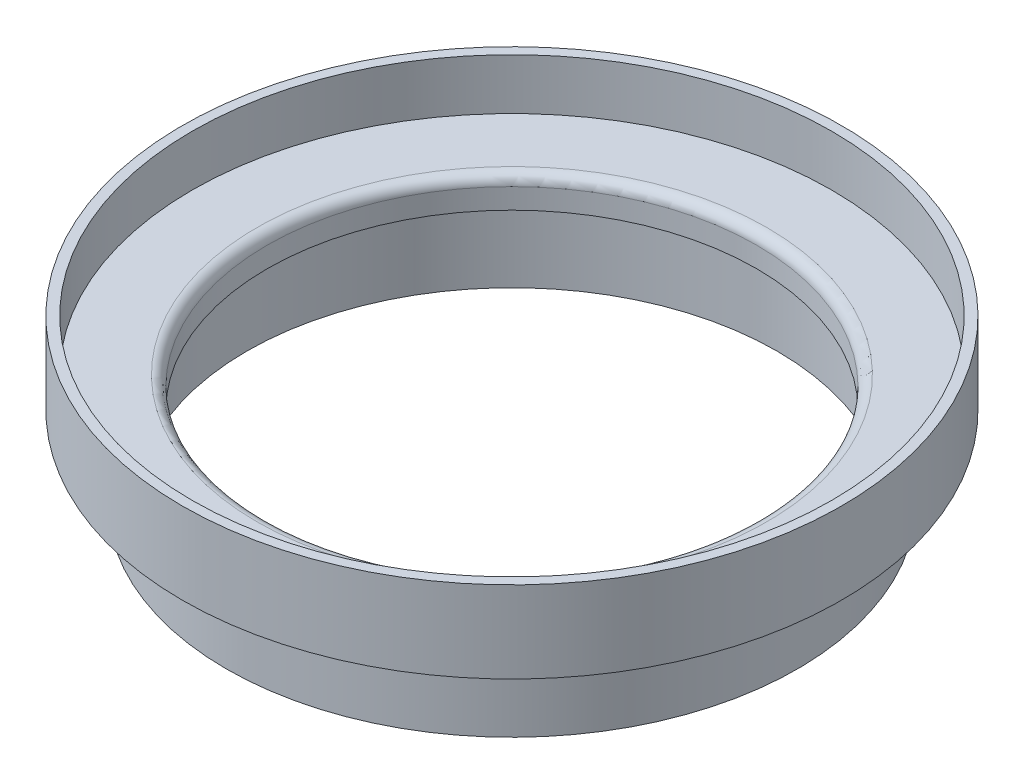
ISO-10303-21;
HEADER;
FILE_DESCRIPTION(('STEP AP214'),'2;1');
FILE_NAME('part.step','',(''),(''),'','','');
FILE_SCHEMA(('AUTOMOTIVE_DESIGN { 1 0 10303 214 1 1 1 1 }'));
ENDSEC;
DATA;
#1=APPLICATION_CONTEXT('core data for automotive mechanical design processes');
#2=APPLICATION_PROTOCOL_DEFINITION('international standard','automotive_design',2000,#1);
#3=PRODUCT_CONTEXT('',#1,'mechanical');
#4=PRODUCT('Part','Part','',(#3));
#5=PRODUCT_RELATED_PRODUCT_CATEGORY('part','',(#4));
#6=PRODUCT_DEFINITION_FORMATION('','',#4);
#7=PRODUCT_DEFINITION_CONTEXT('part definition',#1,'design');
#8=PRODUCT_DEFINITION('design','',#6,#7);
#9=PRODUCT_DEFINITION_SHAPE('','',#8);
#10=(LENGTH_UNIT() NAMED_UNIT(*) SI_UNIT(.MILLI.,.METRE.));
#11=(NAMED_UNIT(*) PLANE_ANGLE_UNIT() SI_UNIT($,.RADIAN.));
#12=(NAMED_UNIT(*) SI_UNIT($,.STERADIAN.) SOLID_ANGLE_UNIT());
#13=UNCERTAINTY_MEASURE_WITH_UNIT(LENGTH_MEASURE(1.E-05),#10,'distance_accuracy_value','');
#14=(GEOMETRIC_REPRESENTATION_CONTEXT(3) GLOBAL_UNCERTAINTY_ASSIGNED_CONTEXT((#13)) GLOBAL_UNIT_ASSIGNED_CONTEXT((#10,
#11,#12)) REPRESENTATION_CONTEXT('',''));
#15=CARTESIAN_POINT('',(0.,0.,0.));
#16=DIRECTION('',(0.,0.,1.));
#17=DIRECTION('',(1.,0.,0.));
#18=AXIS2_PLACEMENT_3D('',#15,#16,#17);
#19=CARTESIAN_POINT('',(-38.1,-3.175,0.));
#20=DIRECTION('',(0.,-1.,0.));
#21=DIRECTION('',(0.,0.,-1.));
#22=AXIS2_PLACEMENT_3D('',#19,#20,#21);
#23=PLANE('',#22);
#24=CARTESIAN_POINT('',(0.,-3.175,0.));
#25=DIRECTION('',(0.,1.,0.));
#26=DIRECTION('',(0.,0.,1.));
#27=AXIS2_PLACEMENT_3D('',#24,#25,#26);
#28=CIRCLE('',#27,38.1);
#29=CARTESIAN_POINT('',(0.,-3.175,38.1));
#30=VERTEX_POINT('',#29);
#31=EDGE_CURVE('E68',#30,#30,#28,.T.);
#32=ORIENTED_EDGE('',*,*,#31,.T.);
#33=EDGE_LOOP('',(#32));
#34=FACE_BOUND('',#33,.T.);
#35=CARTESIAN_POINT('',(0.,-3.175,0.));
#36=DIRECTION('',(0.,1.,0.));
#37=DIRECTION('',(0.,0.,1.));
#38=AXIS2_PLACEMENT_3D('',#35,#36,#37);
#39=CIRCLE('',#38,41.275);
#40=CARTESIAN_POINT('',(0.,-3.175,41.275));
#41=VERTEX_POINT('',#40);
#42=EDGE_CURVE('E10',#41,#41,#39,.T.);
#43=ORIENTED_EDGE('',*,*,#42,.F.);
#44=EDGE_LOOP('',(#43));
#45=FACE_BOUND('',#44,.T.);
#46=ADVANCED_FACE('F31',(#34,#45),#23,.T.);
#47=CARTESIAN_POINT('',(0.,55.,0.));
#48=DIRECTION('',(0.,1.,0.));
#49=DIRECTION('',(0.,0.,1.));
#50=AXIS2_PLACEMENT_3D('',#47,#48,#49);
#51=CYLINDRICAL_SURFACE('',#50,41.275);
#52=ORIENTED_EDGE('',*,*,#42,.T.);
#53=EDGE_LOOP('',(#52));
#54=FACE_BOUND('',#53,.T.);
#55=CARTESIAN_POINT('',(0.,-15.875,0.));
#56=DIRECTION('',(0.,1.,0.));
#57=DIRECTION('',(0.,0.,1.));
#58=AXIS2_PLACEMENT_3D('',#55,#56,#57);
#59=CIRCLE('',#58,41.275);
#60=CARTESIAN_POINT('',(0.,-15.875,41.275));
#61=VERTEX_POINT('',#60);
#62=EDGE_CURVE('E37',#61,#61,#59,.T.);
#63=ORIENTED_EDGE('',*,*,#62,.F.);
#64=EDGE_LOOP('',(#63));
#65=FACE_BOUND('',#64,.T.);
#66=ADVANCED_FACE('F86',(#54,#65),#51,.F.);
#67=CARTESIAN_POINT('',(-44.45,-15.875,0.));
#68=DIRECTION('',(0.,-1.,0.));
#69=DIRECTION('',(0.,0.,-1.));
#70=AXIS2_PLACEMENT_3D('',#67,#68,#69);
#71=PLANE('',#70);
#72=ORIENTED_EDGE('',*,*,#62,.T.);
#73=EDGE_LOOP('',(#72));
#74=FACE_BOUND('',#73,.T.);
#75=CARTESIAN_POINT('',(0.,-15.875,0.));
#76=DIRECTION('',(0.,1.,0.));
#77=DIRECTION('',(0.,0.,1.));
#78=AXIS2_PLACEMENT_3D('',#75,#76,#77);
#79=CIRCLE('',#78,44.45);
#80=CARTESIAN_POINT('',(0.,-15.875,44.45));
#81=VERTEX_POINT('',#80);
#82=EDGE_CURVE('E41',#81,#81,#79,.T.);
#83=ORIENTED_EDGE('',*,*,#82,.F.);
#84=EDGE_LOOP('',(#83));
#85=FACE_BOUND('',#84,.T.);
#86=ADVANCED_FACE('F90',(#74,#85),#71,.T.);
#87=CARTESIAN_POINT('',(0.,55.,0.));
#88=DIRECTION('',(0.,1.,0.));
#89=DIRECTION('',(0.,0.,1.));
#90=AXIS2_PLACEMENT_3D('',#87,#88,#89);
#91=CYLINDRICAL_SURFACE('',#90,44.45);
#92=ORIENTED_EDGE('',*,*,#82,.T.);
#93=EDGE_LOOP('',(#92));
#94=FACE_BOUND('',#93,.T.);
#95=CARTESIAN_POINT('',(0.,-3.175,0.));
#96=DIRECTION('',(0.,1.,0.));
#97=DIRECTION('',(0.,0.,1.));
#98=AXIS2_PLACEMENT_3D('',#95,#96,#97);
#99=CIRCLE('',#98,44.45);
#100=CARTESIAN_POINT('',(0.,-3.175,44.45));
#101=VERTEX_POINT('',#100);
#102=EDGE_CURVE('E45',#101,#101,#99,.T.);
#103=ORIENTED_EDGE('',*,*,#102,.F.);
#104=EDGE_LOOP('',(#103));
#105=FACE_BOUND('',#104,.T.);
#106=ADVANCED_FACE('F94',(#94,#105),#91,.T.);
#107=CARTESIAN_POINT('',(-44.45,-3.175,0.));
#108=DIRECTION('',(0.,-1.,0.));
#109=DIRECTION('',(0.,0.,-1.));
#110=AXIS2_PLACEMENT_3D('',#107,#108,#109);
#111=PLANE('',#110);
#112=ORIENTED_EDGE('',*,*,#102,.T.);
#113=EDGE_LOOP('',(#112));
#114=FACE_BOUND('',#113,.T.);
#115=CARTESIAN_POINT('',(0.,-3.175,0.));
#116=DIRECTION('',(0.,1.,0.));
#117=DIRECTION('',(0.,0.,1.));
#118=AXIS2_PLACEMENT_3D('',#115,#116,#117);
#119=CIRCLE('',#118,51.308);
#120=CARTESIAN_POINT('',(0.,-3.175,51.308));
#121=VERTEX_POINT('',#120);
#122=EDGE_CURVE('E50',#121,#121,#119,.T.);
#123=ORIENTED_EDGE('',*,*,#122,.F.);
#124=EDGE_LOOP('',(#123));
#125=FACE_BOUND('',#124,.T.);
#126=ADVANCED_FACE('F100',(#114,#125),#111,.T.);
#127=CARTESIAN_POINT('',(0.,55.,0.));
#128=DIRECTION('',(0.,1.,0.));
#129=DIRECTION('',(0.,0.,1.));
#130=AXIS2_PLACEMENT_3D('',#127,#128,#129);
#131=CYLINDRICAL_SURFACE('',#130,51.308);
#132=ORIENTED_EDGE('',*,*,#122,.T.);
#133=EDGE_LOOP('',(#132));
#134=FACE_BOUND('',#133,.T.);
#135=CARTESIAN_POINT('',(0.,9.525,0.));
#136=DIRECTION('',(0.,1.,0.));
#137=DIRECTION('',(0.,0.,1.));
#138=AXIS2_PLACEMENT_3D('',#135,#136,#137);
#139=CIRCLE('',#138,51.308);
#140=CARTESIAN_POINT('',(0.,9.525,51.308));
#141=VERTEX_POINT('',#140);
#142=EDGE_CURVE('E53',#141,#141,#139,.T.);
#143=ORIENTED_EDGE('',*,*,#142,.F.);
#144=EDGE_LOOP('',(#143));
#145=FACE_BOUND('',#144,.T.);
#146=ADVANCED_FACE('F104',(#134,#145),#131,.T.);
#147=CARTESIAN_POINT('',(-51.308,9.525,0.));
#148=DIRECTION('',(0.,1.,0.));
#149=DIRECTION('',(0.,0.,1.));
#150=AXIS2_PLACEMENT_3D('',#147,#148,#149);
#151=PLANE('',#150);
#152=ORIENTED_EDGE('',*,*,#142,.T.);
#153=EDGE_LOOP('',(#152));
#154=FACE_BOUND('',#153,.T.);
#155=CARTESIAN_POINT('',(0.,9.525,0.));
#156=DIRECTION('',(0.,1.,0.));
#157=DIRECTION('',(0.,0.,1.));
#158=AXIS2_PLACEMENT_3D('',#155,#156,#157);
#159=CIRCLE('',#158,49.784);
#160=CARTESIAN_POINT('',(0.,9.525,49.784));
#161=VERTEX_POINT('',#160);
#162=EDGE_CURVE('E56',#161,#161,#159,.T.);
#163=ORIENTED_EDGE('',*,*,#162,.F.);
#164=EDGE_LOOP('',(#163));
#165=FACE_BOUND('',#164,.T.);
#166=ADVANCED_FACE('F108',(#154,#165),#151,.T.);
#167=CARTESIAN_POINT('',(0.,55.,0.));
#168=DIRECTION('',(0.,1.,0.));
#169=DIRECTION('',(0.,0.,1.));
#170=AXIS2_PLACEMENT_3D('',#167,#168,#169);
#171=CYLINDRICAL_SURFACE('',#170,49.784);
#172=ORIENTED_EDGE('',*,*,#162,.T.);
#173=EDGE_LOOP('',(#172));
#174=FACE_BOUND('',#173,.T.);
#175=CARTESIAN_POINT('',(0.,1.5875,0.));
#176=DIRECTION('',(0.,1.,0.));
#177=DIRECTION('',(0.,0.,1.));
#178=AXIS2_PLACEMENT_3D('',#175,#176,#177);
#179=CIRCLE('',#178,49.784);
#180=CARTESIAN_POINT('',(0.,1.5875,49.784));
#181=VERTEX_POINT('',#180);
#182=EDGE_CURVE('E59',#181,#181,#179,.T.);
#183=ORIENTED_EDGE('',*,*,#182,.F.);
#184=EDGE_LOOP('',(#183));
#185=FACE_BOUND('',#184,.T.);
#186=ADVANCED_FACE('F112',(#174,#185),#171,.F.);
#187=CARTESIAN_POINT('',(-39.6875,1.5875,0.));
#188=DIRECTION('',(0.,1.,0.));
#189=DIRECTION('',(0.,0.,1.));
#190=AXIS2_PLACEMENT_3D('',#187,#188,#189);
#191=PLANE('',#190);
#192=ORIENTED_EDGE('',*,*,#182,.T.);
#193=EDGE_LOOP('',(#192));
#194=FACE_BOUND('',#193,.T.);
#195=CARTESIAN_POINT('',(0.,1.5875,0.));
#196=DIRECTION('',(0.,1.,0.));
#197=DIRECTION('',(0.,0.,1.));
#198=AXIS2_PLACEMENT_3D('',#195,#196,#197);
#199=CIRCLE('',#198,39.6875);
#200=CARTESIAN_POINT('',(0.,1.5875,39.6875));
#201=VERTEX_POINT('',#200);
#202=EDGE_CURVE('E62',#201,#201,#199,.T.);
#203=ORIENTED_EDGE('',*,*,#202,.F.);
#204=EDGE_LOOP('',(#203));
#205=FACE_BOUND('',#204,.T.);
#206=ADVANCED_FACE('F82',(#194,#205),#191,.T.);
#207=CARTESIAN_POINT('',(0.,0.,0.));
#208=DIRECTION('',(0.,1.,0.));
#209=DIRECTION('',(0.,0.,1.));
#210=AXIS2_PLACEMENT_3D('',#207,#208,#209);
#211=TOROIDAL_SURFACE('',#210,39.6875,1.5875);
#212=ORIENTED_EDGE('',*,*,#202,.T.);
#213=EDGE_LOOP('',(#212));
#214=FACE_BOUND('',#213,.T.);
#215=CARTESIAN_POINT('',(0.,0.,0.));
#216=DIRECTION('',(0.,1.,0.));
#217=DIRECTION('',(0.,0.,1.));
#218=AXIS2_PLACEMENT_3D('',#215,#216,#217);
#219=CIRCLE('',#218,38.1);
#220=CARTESIAN_POINT('',(0.,0.,38.1));
#221=VERTEX_POINT('',#220);
#222=EDGE_CURVE('E65',#221,#221,#219,.T.);
#223=ORIENTED_EDGE('',*,*,#222,.F.);
#224=EDGE_LOOP('',(#223));
#225=FACE_BOUND('',#224,.T.);
#226=ADVANCED_FACE('F76',(#214,#225),#211,.T.);
#227=CARTESIAN_POINT('',(0.,55.,0.));
#228=DIRECTION('',(0.,1.,0.));
#229=DIRECTION('',(0.,0.,1.));
#230=AXIS2_PLACEMENT_3D('',#227,#228,#229);
#231=CYLINDRICAL_SURFACE('',#230,38.1);
#232=ORIENTED_EDGE('',*,*,#222,.T.);
#233=EDGE_LOOP('',(#232));
#234=FACE_BOUND('',#233,.T.);
#235=ORIENTED_EDGE('',*,*,#31,.F.);
#236=EDGE_LOOP('',(#235));
#237=FACE_BOUND('',#236,.T.);
#238=ADVANCED_FACE('F74',(#234,#237),#231,.F.);
#239=CLOSED_SHELL('',(#46,#66,#86,#106,#126,#146,#166,#186,#206,#226,#238));
#240=MANIFOLD_SOLID_BREP('B2',#239);
#241=ADVANCED_BREP_SHAPE_REPRESENTATION('',(#18,#240),#14);
#242=SHAPE_DEFINITION_REPRESENTATION(#9,#241);
ENDSEC;
END-ISO-10303-21;
